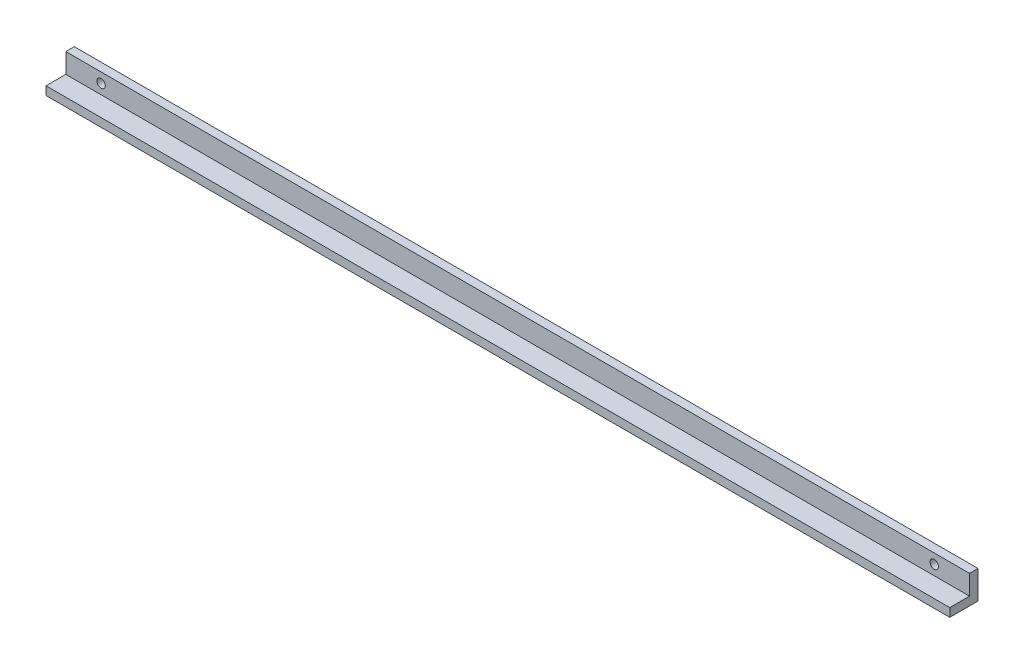
ISO-10303-21;
HEADER;
FILE_DESCRIPTION(('STEP AP214'),'2;1');
FILE_NAME('part.step','',(''),(''),'','','');
FILE_SCHEMA(('AUTOMOTIVE_DESIGN { 1 0 10303 214 1 1 1 1 }'));
ENDSEC;
DATA;
#1=APPLICATION_CONTEXT('core data for automotive mechanical design processes');
#2=APPLICATION_PROTOCOL_DEFINITION('international standard','automotive_design',2000,#1);
#3=PRODUCT_CONTEXT('',#1,'mechanical');
#4=PRODUCT('Part','Part','',(#3));
#5=PRODUCT_RELATED_PRODUCT_CATEGORY('part','',(#4));
#6=PRODUCT_DEFINITION_FORMATION('','',#4);
#7=PRODUCT_DEFINITION_CONTEXT('part definition',#1,'design');
#8=PRODUCT_DEFINITION('design','',#6,#7);
#9=PRODUCT_DEFINITION_SHAPE('','',#8);
#10=(LENGTH_UNIT() NAMED_UNIT(*) SI_UNIT(.MILLI.,.METRE.));
#11=(NAMED_UNIT(*) PLANE_ANGLE_UNIT() SI_UNIT($,.RADIAN.));
#12=(NAMED_UNIT(*) SI_UNIT($,.STERADIAN.) SOLID_ANGLE_UNIT());
#13=UNCERTAINTY_MEASURE_WITH_UNIT(LENGTH_MEASURE(1.E-05),#10,'distance_accuracy_value','');
#14=(GEOMETRIC_REPRESENTATION_CONTEXT(3) GLOBAL_UNCERTAINTY_ASSIGNED_CONTEXT((#13)) GLOBAL_UNIT_ASSIGNED_CONTEXT((#10,
#11,#12)) REPRESENTATION_CONTEXT('',''));
#15=CARTESIAN_POINT('',(0.,0.,0.));
#16=DIRECTION('',(0.,0.,1.));
#17=DIRECTION('',(1.,0.,0.));
#18=AXIS2_PLACEMENT_3D('',#15,#16,#17);
#19=CARTESIAN_POINT('',(320.,10.,0.));
#20=DIRECTION('',(0.,0.,1.));
#21=DIRECTION('',(0.,-1.,0.));
#22=AXIS2_PLACEMENT_3D('',#19,#20,#21);
#23=PLANE('',#22);
#24=CARTESIAN_POINT('',(307.5,6.50000000000004,0.));
#25=DIRECTION('',(0.,0.,1.));
#26=DIRECTION('',(-1.,0.,0.));
#27=AXIS2_PLACEMENT_3D('',#24,#25,#26);
#28=CIRCLE('',#27,1.50000000000002);
#29=CARTESIAN_POINT('',(306.,6.50000000000004,0.));
#30=VERTEX_POINT('',#29);
#31=EDGE_CURVE('E162',#30,#30,#28,.T.);
#32=ORIENTED_EDGE('',*,*,#31,.T.);
#33=EDGE_LOOP('',(#32));
#34=FACE_BOUND('',#33,.T.);
#35=CARTESIAN_POINT('',(12.5,6.5,0.));
#36=DIRECTION('',(0.,0.,1.));
#37=DIRECTION('',(1.,0.,0.));
#38=AXIS2_PLACEMENT_3D('',#35,#36,#37);
#39=CIRCLE('',#38,1.5);
#40=CARTESIAN_POINT('',(14.,6.5,0.));
#41=VERTEX_POINT('',#40);
#42=EDGE_CURVE('E123',#41,#41,#39,.T.);
#43=ORIENTED_EDGE('',*,*,#42,.T.);
#44=EDGE_LOOP('',(#43));
#45=FACE_BOUND('',#44,.T.);
#46=DIRECTION('',(0.,1.,0.));
#47=VECTOR('',#46,1.);
#48=CARTESIAN_POINT('',(0.,10.,0.));
#49=LINE('',#48,#47);
#50=CARTESIAN_POINT('',(0.,0.,0.));
#51=VERTEX_POINT('',#50);
#52=CARTESIAN_POINT('',(0.,10.,0.));
#53=VERTEX_POINT('',#52);
#54=EDGE_CURVE('E119',#51,#53,#49,.T.);
#55=ORIENTED_EDGE('',*,*,#54,.T.);
#56=DIRECTION('',(-1.,0.,0.));
#57=VECTOR('',#56,1.);
#58=CARTESIAN_POINT('',(320.,10.,0.));
#59=LINE('',#58,#57);
#60=CARTESIAN_POINT('',(320.,10.,0.));
#61=VERTEX_POINT('',#60);
#62=EDGE_CURVE('E11',#61,#53,#59,.T.);
#63=ORIENTED_EDGE('',*,*,#62,.F.);
#64=DIRECTION('',(0.,1.,0.));
#65=VECTOR('',#64,1.);
#66=CARTESIAN_POINT('',(320.,10.,0.));
#67=LINE('',#66,#65);
#68=CARTESIAN_POINT('',(320.,0.,0.));
#69=VERTEX_POINT('',#68);
#70=EDGE_CURVE('E130',#69,#61,#67,.T.);
#71=ORIENTED_EDGE('',*,*,#70,.F.);
#72=DIRECTION('',(-1.,0.,0.));
#73=VECTOR('',#72,1.);
#74=CARTESIAN_POINT('',(320.,0.,0.));
#75=LINE('',#74,#73);
#76=EDGE_CURVE('E115',#69,#51,#75,.T.);
#77=ORIENTED_EDGE('',*,*,#76,.T.);
#78=EDGE_LOOP('',(#55,#63,#71,#77));
#79=FACE_BOUND('',#78,.T.);
#80=ADVANCED_FACE('F35',(#34,#45,#79),#23,.F.);
#81=CARTESIAN_POINT('',(320.,10.,3.));
#82=DIRECTION('',(0.,-1.,0.));
#83=DIRECTION('',(0.,0.,-1.));
#84=AXIS2_PLACEMENT_3D('',#81,#82,#83);
#85=PLANE('',#84);
#86=DIRECTION('',(0.,0.,1.));
#87=VECTOR('',#86,1.);
#88=CARTESIAN_POINT('',(0.,10.,3.));
#89=LINE('',#88,#87);
#90=CARTESIAN_POINT('',(0.,10.,3.));
#91=VERTEX_POINT('',#90);
#92=EDGE_CURVE('E122',#53,#91,#89,.T.);
#93=ORIENTED_EDGE('',*,*,#92,.T.);
#94=DIRECTION('',(-1.,0.,0.));
#95=VECTOR('',#94,1.);
#96=CARTESIAN_POINT('',(320.,10.,3.));
#97=LINE('',#96,#95);
#98=CARTESIAN_POINT('',(320.,10.,3.));
#99=VERTEX_POINT('',#98);
#100=EDGE_CURVE('E43',#99,#91,#97,.T.);
#101=ORIENTED_EDGE('',*,*,#100,.F.);
#102=DIRECTION('',(0.,0.,1.));
#103=VECTOR('',#102,1.);
#104=CARTESIAN_POINT('',(320.,10.,3.));
#105=LINE('',#104,#103);
#106=EDGE_CURVE('E88',#61,#99,#105,.T.);
#107=ORIENTED_EDGE('',*,*,#106,.F.);
#108=ORIENTED_EDGE('',*,*,#62,.T.);
#109=EDGE_LOOP('',(#93,#101,#107,#108));
#110=FACE_BOUND('',#109,.T.);
#111=ADVANCED_FACE('F154',(#110),#85,.F.);
#112=CARTESIAN_POINT('',(320.,10.,3.));
#113=DIRECTION('',(0.,0.,-1.));
#114=DIRECTION('',(0.,1.,0.));
#115=AXIS2_PLACEMENT_3D('',#112,#113,#114);
#116=PLANE('',#115);
#117=CARTESIAN_POINT('',(307.5,6.50000000000004,3.));
#118=DIRECTION('',(0.,0.,1.));
#119=DIRECTION('',(-1.,0.,0.));
#120=AXIS2_PLACEMENT_3D('',#117,#118,#119);
#121=CIRCLE('',#120,1.50000000000002);
#122=CARTESIAN_POINT('',(306.,6.50000000000004,3.));
#123=VERTEX_POINT('',#122);
#124=EDGE_CURVE('E171',#123,#123,#121,.T.);
#125=ORIENTED_EDGE('',*,*,#124,.F.);
#126=EDGE_LOOP('',(#125));
#127=FACE_BOUND('',#126,.T.);
#128=CARTESIAN_POINT('',(12.5,6.5,3.));
#129=DIRECTION('',(0.,0.,1.));
#130=DIRECTION('',(1.,0.,0.));
#131=AXIS2_PLACEMENT_3D('',#128,#129,#130);
#132=CIRCLE('',#131,1.5);
#133=CARTESIAN_POINT('',(14.,6.5,3.));
#134=VERTEX_POINT('',#133);
#135=EDGE_CURVE('E166',#134,#134,#132,.T.);
#136=ORIENTED_EDGE('',*,*,#135,.F.);
#137=EDGE_LOOP('',(#136));
#138=FACE_BOUND('',#137,.T.);
#139=DIRECTION('',(0.,-1.,0.));
#140=VECTOR('',#139,1.);
#141=CARTESIAN_POINT('',(0.,10.,3.));
#142=LINE('',#141,#140);
#143=CARTESIAN_POINT('',(0.,3.,3.));
#144=VERTEX_POINT('',#143);
#145=EDGE_CURVE('E125',#91,#144,#142,.T.);
#146=ORIENTED_EDGE('',*,*,#145,.T.);
#147=DIRECTION('',(-1.,0.,0.));
#148=VECTOR('',#147,1.);
#149=CARTESIAN_POINT('',(320.,3.,3.));
#150=LINE('',#149,#148);
#151=CARTESIAN_POINT('',(320.,3.,3.));
#152=VERTEX_POINT('',#151);
#153=EDGE_CURVE('E110',#152,#144,#150,.T.);
#154=ORIENTED_EDGE('',*,*,#153,.F.);
#155=DIRECTION('',(0.,-1.,0.));
#156=VECTOR('',#155,1.);
#157=CARTESIAN_POINT('',(320.,10.,3.));
#158=LINE('',#157,#156);
#159=EDGE_CURVE('E101',#99,#152,#158,.T.);
#160=ORIENTED_EDGE('',*,*,#159,.F.);
#161=ORIENTED_EDGE('',*,*,#100,.T.);
#162=EDGE_LOOP('',(#146,#154,#160,#161));
#163=FACE_BOUND('',#162,.T.);
#164=ADVANCED_FACE('F136',(#127,#138,#163),#116,.F.);
#165=CARTESIAN_POINT('',(320.,3.,10.));
#166=DIRECTION('',(0.,-1.,0.));
#167=DIRECTION('',(0.,0.,-1.));
#168=AXIS2_PLACEMENT_3D('',#165,#166,#167);
#169=PLANE('',#168);
#170=DIRECTION('',(0.,0.,1.));
#171=VECTOR('',#170,1.);
#172=CARTESIAN_POINT('',(0.,3.,10.));
#173=LINE('',#172,#171);
#174=CARTESIAN_POINT('',(0.,3.,10.));
#175=VERTEX_POINT('',#174);
#176=EDGE_CURVE('E109',#144,#175,#173,.T.);
#177=ORIENTED_EDGE('',*,*,#176,.T.);
#178=DIRECTION('',(-1.,0.,0.));
#179=VECTOR('',#178,1.);
#180=CARTESIAN_POINT('',(320.,3.,10.));
#181=LINE('',#180,#179);
#182=CARTESIAN_POINT('',(320.,3.,10.));
#183=VERTEX_POINT('',#182);
#184=EDGE_CURVE('E106',#183,#175,#181,.T.);
#185=ORIENTED_EDGE('',*,*,#184,.F.);
#186=DIRECTION('',(0.,0.,1.));
#187=VECTOR('',#186,1.);
#188=CARTESIAN_POINT('',(320.,3.,10.));
#189=LINE('',#188,#187);
#190=EDGE_CURVE('E95',#152,#183,#189,.T.);
#191=ORIENTED_EDGE('',*,*,#190,.F.);
#192=ORIENTED_EDGE('',*,*,#153,.T.);
#193=EDGE_LOOP('',(#177,#185,#191,#192));
#194=FACE_BOUND('',#193,.T.);
#195=ADVANCED_FACE('F107',(#194),#169,.F.);
#196=CARTESIAN_POINT('',(320.,0.,10.));
#197=DIRECTION('',(0.,0.,-1.));
#198=DIRECTION('',(-1.,0.,0.));
#199=AXIS2_PLACEMENT_3D('',#196,#197,#198);
#200=PLANE('',#199);
#201=DIRECTION('',(0.,-1.,0.));
#202=VECTOR('',#201,1.);
#203=CARTESIAN_POINT('',(0.,0.,10.));
#204=LINE('',#203,#202);
#205=CARTESIAN_POINT('',(0.,0.,10.));
#206=VERTEX_POINT('',#205);
#207=EDGE_CURVE('E74',#175,#206,#204,.T.);
#208=ORIENTED_EDGE('',*,*,#207,.T.);
#209=DIRECTION('',(-1.,0.,0.));
#210=VECTOR('',#209,1.);
#211=CARTESIAN_POINT('',(320.,0.,10.));
#212=LINE('',#211,#210);
#213=CARTESIAN_POINT('',(320.,0.,10.));
#214=VERTEX_POINT('',#213);
#215=EDGE_CURVE('E111',#214,#206,#212,.T.);
#216=ORIENTED_EDGE('',*,*,#215,.F.);
#217=DIRECTION('',(0.,-1.,0.));
#218=VECTOR('',#217,1.);
#219=CARTESIAN_POINT('',(320.,0.,10.));
#220=LINE('',#219,#218);
#221=EDGE_CURVE('E99',#183,#214,#220,.T.);
#222=ORIENTED_EDGE('',*,*,#221,.F.);
#223=ORIENTED_EDGE('',*,*,#184,.T.);
#224=EDGE_LOOP('',(#208,#216,#222,#223));
#225=FACE_BOUND('',#224,.T.);
#226=ADVANCED_FACE('F113',(#225),#200,.F.);
#227=CARTESIAN_POINT('',(320.,0.,0.));
#228=DIRECTION('',(0.,1.,0.));
#229=DIRECTION('',(0.,0.,1.));
#230=AXIS2_PLACEMENT_3D('',#227,#228,#229);
#231=PLANE('',#230);
#232=DIRECTION('',(0.,0.,-1.));
#233=VECTOR('',#232,1.);
#234=CARTESIAN_POINT('',(0.,0.,0.));
#235=LINE('',#234,#233);
#236=EDGE_CURVE('E80',#206,#51,#235,.T.);
#237=ORIENTED_EDGE('',*,*,#236,.T.);
#238=ORIENTED_EDGE('',*,*,#76,.F.);
#239=DIRECTION('',(0.,0.,-1.));
#240=VECTOR('',#239,1.);
#241=CARTESIAN_POINT('',(320.,0.,0.));
#242=LINE('',#241,#240);
#243=EDGE_CURVE('E51',#214,#69,#242,.T.);
#244=ORIENTED_EDGE('',*,*,#243,.F.);
#245=ORIENTED_EDGE('',*,*,#215,.T.);
#246=EDGE_LOOP('',(#237,#238,#244,#245));
#247=FACE_BOUND('',#246,.T.);
#248=ADVANCED_FACE('F143',(#247),#231,.F.);
#249=CARTESIAN_POINT('',(320.,0.,0.));
#250=DIRECTION('',(-1.,0.,0.));
#251=DIRECTION('',(0.,0.,1.));
#252=AXIS2_PLACEMENT_3D('',#249,#250,#251);
#253=PLANE('',#252);
#254=ORIENTED_EDGE('',*,*,#70,.T.);
#255=ORIENTED_EDGE('',*,*,#106,.T.);
#256=ORIENTED_EDGE('',*,*,#159,.T.);
#257=ORIENTED_EDGE('',*,*,#190,.T.);
#258=ORIENTED_EDGE('',*,*,#221,.T.);
#259=ORIENTED_EDGE('',*,*,#243,.T.);
#260=EDGE_LOOP('',(#254,#255,#256,#257,#258,#259));
#261=FACE_BOUND('',#260,.T.);
#262=ADVANCED_FACE('F97',(#261),#253,.F.);
#263=CARTESIAN_POINT('',(0.,0.,0.));
#264=DIRECTION('',(-1.,0.,0.));
#265=DIRECTION('',(0.,0.,1.));
#266=AXIS2_PLACEMENT_3D('',#263,#264,#265);
#267=PLANE('',#266);
#268=ORIENTED_EDGE('',*,*,#54,.F.);
#269=ORIENTED_EDGE('',*,*,#236,.F.);
#270=ORIENTED_EDGE('',*,*,#207,.F.);
#271=ORIENTED_EDGE('',*,*,#176,.F.);
#272=ORIENTED_EDGE('',*,*,#145,.F.);
#273=ORIENTED_EDGE('',*,*,#92,.F.);
#274=EDGE_LOOP('',(#268,#269,#270,#271,#272,#273));
#275=FACE_BOUND('',#274,.T.);
#276=ADVANCED_FACE('F139',(#275),#267,.T.);
#277=CARTESIAN_POINT('',(12.5,6.5,0.));
#278=DIRECTION('',(0.,0.,1.));
#279=DIRECTION('',(1.,0.,0.));
#280=AXIS2_PLACEMENT_3D('',#277,#278,#279);
#281=CYLINDRICAL_SURFACE('',#280,1.5);
#282=ORIENTED_EDGE('',*,*,#42,.F.);
#283=EDGE_LOOP('',(#282));
#284=FACE_BOUND('',#283,.T.);
#285=ORIENTED_EDGE('',*,*,#135,.T.);
#286=EDGE_LOOP('',(#285));
#287=FACE_BOUND('',#286,.T.);
#288=ADVANCED_FACE('F185',(#284,#287),#281,.F.);
#289=CARTESIAN_POINT('',(307.5,6.50000000000004,0.));
#290=DIRECTION('',(0.,0.,1.));
#291=DIRECTION('',(1.,0.,0.));
#292=AXIS2_PLACEMENT_3D('',#289,#290,#291);
#293=CYLINDRICAL_SURFACE('',#292,1.50000000000002);
#294=ORIENTED_EDGE('',*,*,#31,.F.);
#295=EDGE_LOOP('',(#294));
#296=FACE_BOUND('',#295,.T.);
#297=ORIENTED_EDGE('',*,*,#124,.T.);
#298=EDGE_LOOP('',(#297));
#299=FACE_BOUND('',#298,.T.);
#300=ADVANCED_FACE('F178',(#296,#299),#293,.F.);
#301=CLOSED_SHELL('',(#80,#111,#164,#195,#226,#248,#262,#276,#288,#300));
#302=MANIFOLD_SOLID_BREP('B2',#301);
#303=ADVANCED_BREP_SHAPE_REPRESENTATION('',(#18,#302),#14);
#304=SHAPE_DEFINITION_REPRESENTATION(#9,#303);
ENDSEC;
END-ISO-10303-21;
